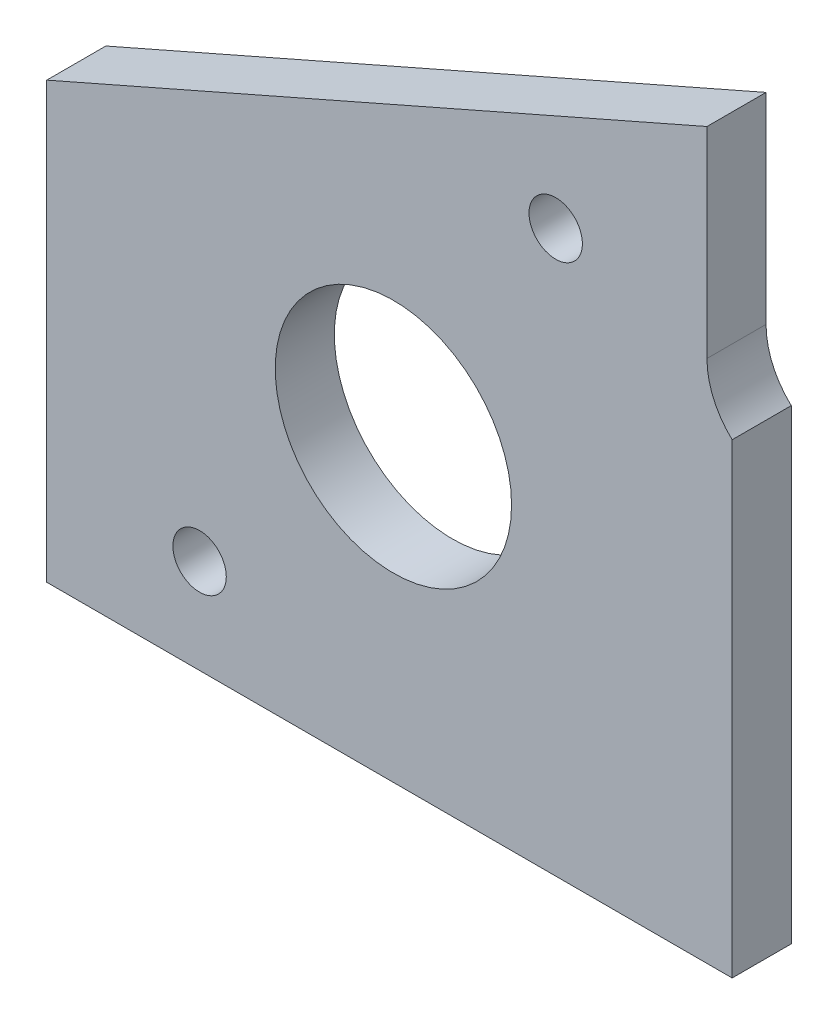
ISO-10303-21;
HEADER;
FILE_DESCRIPTION(('STEP AP214'),'2;1');
FILE_NAME('part.step','',(''),(''),'','','');
FILE_SCHEMA(('AUTOMOTIVE_DESIGN { 1 0 10303 214 1 1 1 1 }'));
ENDSEC;
DATA;
#1=APPLICATION_CONTEXT('core data for automotive mechanical design processes');
#2=APPLICATION_PROTOCOL_DEFINITION('international standard','automotive_design',2000,#1);
#3=PRODUCT_CONTEXT('',#1,'mechanical');
#4=PRODUCT('Part','Part','',(#3));
#5=PRODUCT_RELATED_PRODUCT_CATEGORY('part','',(#4));
#6=PRODUCT_DEFINITION_FORMATION('','',#4);
#7=PRODUCT_DEFINITION_CONTEXT('part definition',#1,'design');
#8=PRODUCT_DEFINITION('design','',#6,#7);
#9=PRODUCT_DEFINITION_SHAPE('','',#8);
#10=(LENGTH_UNIT() NAMED_UNIT(*) SI_UNIT(.MILLI.,.METRE.));
#11=(NAMED_UNIT(*) PLANE_ANGLE_UNIT() SI_UNIT($,.RADIAN.));
#12=(NAMED_UNIT(*) SI_UNIT($,.STERADIAN.) SOLID_ANGLE_UNIT());
#13=UNCERTAINTY_MEASURE_WITH_UNIT(LENGTH_MEASURE(1.E-05),#10,'distance_accuracy_value','');
#14=(GEOMETRIC_REPRESENTATION_CONTEXT(3) GLOBAL_UNCERTAINTY_ASSIGNED_CONTEXT((#13)) GLOBAL_UNIT_ASSIGNED_CONTEXT((#10,
#11,#12)) REPRESENTATION_CONTEXT('',''));
#15=CARTESIAN_POINT('',(0.,0.,0.));
#16=DIRECTION('',(0.,0.,1.));
#17=DIRECTION('',(1.,0.,0.));
#18=AXIS2_PLACEMENT_3D('',#15,#16,#17);
#19=CARTESIAN_POINT('',(-69.2149999999997,22.8600000000018,4.7625));
#20=DIRECTION('',(0.,1.,0.));
#21=DIRECTION('',(0.,0.,1.));
#22=AXIS2_PLACEMENT_3D('',#19,#20,#21);
#23=PLANE('',#22);
#24=DIRECTION('',(1.,0.,0.));
#25=VECTOR('',#24,1.);
#26=CARTESIAN_POINT('',(-69.2149999999997,22.8600000000018,0.));
#27=LINE('',#26,#25);
#28=CARTESIAN_POINT('',(-69.2149999999997,22.8600000000018,0.));
#29=VERTEX_POINT('',#28);
#30=CARTESIAN_POINT('',(-13.9699999999997,22.8600000000018,0.));
#31=VERTEX_POINT('',#30);
#32=EDGE_CURVE('E118',#29,#31,#27,.T.);
#33=ORIENTED_EDGE('',*,*,#32,.T.);
#34=DIRECTION('',(0.,0.,-1.));
#35=VECTOR('',#34,1.);
#36=CARTESIAN_POINT('',(-13.9699999999997,22.8600000000018,4.7625));
#37=LINE('',#36,#35);
#38=CARTESIAN_POINT('',(-13.9699999999997,22.8600000000018,4.7625));
#39=VERTEX_POINT('',#38);
#40=EDGE_CURVE('E11',#39,#31,#37,.T.);
#41=ORIENTED_EDGE('',*,*,#40,.F.);
#42=DIRECTION('',(1.,0.,0.));
#43=VECTOR('',#42,1.);
#44=CARTESIAN_POINT('',(-69.2149999999997,22.8600000000018,4.7625));
#45=LINE('',#44,#43);
#46=CARTESIAN_POINT('',(-69.2149999999997,22.8600000000018,4.7625));
#47=VERTEX_POINT('',#46);
#48=EDGE_CURVE('E130',#47,#39,#45,.T.);
#49=ORIENTED_EDGE('',*,*,#48,.F.);
#50=DIRECTION('',(0.,0.,-1.));
#51=VECTOR('',#50,1.);
#52=CARTESIAN_POINT('',(-69.2149999999997,22.8600000000018,4.7625));
#53=LINE('',#52,#51);
#54=EDGE_CURVE('E114',#47,#29,#53,.T.);
#55=ORIENTED_EDGE('',*,*,#54,.T.);
#56=EDGE_LOOP('',(#33,#41,#49,#55));
#57=FACE_BOUND('',#56,.T.);
#58=ADVANCED_FACE('F34',(#57),#23,.F.);
#59=CARTESIAN_POINT('',(-13.9699999999997,22.8600000000018,4.7625));
#60=DIRECTION('',(-1.,0.,0.));
#61=DIRECTION('',(0.,-1.,0.));
#62=AXIS2_PLACEMENT_3D('',#59,#60,#61);
#63=PLANE('',#62);
#64=DIRECTION('',(0.,1.,0.));
#65=VECTOR('',#64,1.);
#66=CARTESIAN_POINT('',(-13.9699999999997,22.8600000000018,0.));
#67=LINE('',#66,#65);
#68=CARTESIAN_POINT('',(-13.9699999999997,60.4316030939267,0.));
#69=VERTEX_POINT('',#68);
#70=EDGE_CURVE('E121',#31,#69,#67,.T.);
#71=ORIENTED_EDGE('',*,*,#70,.T.);
#72=DIRECTION('',(0.,0.,-1.));
#73=VECTOR('',#72,1.);
#74=CARTESIAN_POINT('',(-13.9699999999997,60.4316030939267,4.7625));
#75=LINE('',#74,#73);
#76=CARTESIAN_POINT('',(-13.9699999999997,60.4316030939267,4.7625));
#77=VERTEX_POINT('',#76);
#78=EDGE_CURVE('E42',#77,#69,#75,.T.);
#79=ORIENTED_EDGE('',*,*,#78,.F.);
#80=DIRECTION('',(0.,1.,0.));
#81=VECTOR('',#80,1.);
#82=CARTESIAN_POINT('',(-13.9699999999997,22.8600000000018,4.7625));
#83=LINE('',#82,#81);
#84=EDGE_CURVE('E87',#39,#77,#83,.T.);
#85=ORIENTED_EDGE('',*,*,#84,.F.);
#86=ORIENTED_EDGE('',*,*,#40,.T.);
#87=EDGE_LOOP('',(#71,#79,#85,#86));
#88=FACE_BOUND('',#87,.T.);
#89=ADVANCED_FACE('F155',(#88),#63,.F.);
#90=CARTESIAN_POINT('',(-9.65199999999967,65.0875000000018,4.7625));
#91=DIRECTION('',(0.,0.,-1.));
#92=DIRECTION('',(-1.,0.,0.));
#93=AXIS2_PLACEMENT_3D('',#90,#91,#92);
#94=CYLINDRICAL_SURFACE('',#93,6.35);
#95=CARTESIAN_POINT('',(-9.65199999999967,65.0875000000018,0.));
#96=DIRECTION('',(0.,0.,-1.));
#97=DIRECTION('',(1.,0.,0.));
#98=AXIS2_PLACEMENT_3D('',#95,#96,#97);
#99=CIRCLE('',#98,6.35);
#100=CARTESIAN_POINT('',(-16.0019999999997,65.0875000000018,0.));
#101=VERTEX_POINT('',#100);
#102=EDGE_CURVE('E124',#69,#101,#99,.T.);
#103=ORIENTED_EDGE('',*,*,#102,.T.);
#104=DIRECTION('',(0.,0.,-1.));
#105=VECTOR('',#104,1.);
#106=CARTESIAN_POINT('',(-16.0019999999997,65.0875000000018,4.7625));
#107=LINE('',#106,#105);
#108=CARTESIAN_POINT('',(-16.0019999999997,65.0875000000018,4.7625));
#109=VERTEX_POINT('',#108);
#110=EDGE_CURVE('E109',#109,#101,#107,.T.);
#111=ORIENTED_EDGE('',*,*,#110,.F.);
#112=CARTESIAN_POINT('',(-9.65199999999967,65.0875000000018,4.7625));
#113=DIRECTION('',(0.,0.,-1.));
#114=DIRECTION('',(1.,0.,0.));
#115=AXIS2_PLACEMENT_3D('',#112,#113,#114);
#116=CIRCLE('',#115,6.35);
#117=EDGE_CURVE('E100',#77,#109,#116,.T.);
#118=ORIENTED_EDGE('',*,*,#117,.F.);
#119=ORIENTED_EDGE('',*,*,#78,.T.);
#120=EDGE_LOOP('',(#103,#111,#118,#119));
#121=FACE_BOUND('',#120,.T.);
#122=ADVANCED_FACE('F136',(#121),#94,.F.);
#123=CARTESIAN_POINT('',(-16.0019999999997,65.0875000000018,4.7625));
#124=DIRECTION('',(-1.,0.,0.));
#125=DIRECTION('',(0.,-1.,0.));
#126=AXIS2_PLACEMENT_3D('',#123,#124,#125);
#127=PLANE('',#126);
#128=DIRECTION('',(0.,1.,0.));
#129=VECTOR('',#128,1.);
#130=CARTESIAN_POINT('',(-16.0019999999997,65.0875000000018,0.));
#131=LINE('',#130,#129);
#132=CARTESIAN_POINT('',(-16.0019999999997,81.2800000000018,0.));
#133=VERTEX_POINT('',#132);
#134=EDGE_CURVE('E108',#101,#133,#131,.T.);
#135=ORIENTED_EDGE('',*,*,#134,.T.);
#136=DIRECTION('',(0.,0.,-1.));
#137=VECTOR('',#136,1.);
#138=CARTESIAN_POINT('',(-16.0019999999997,81.2800000000018,4.7625));
#139=LINE('',#138,#137);
#140=CARTESIAN_POINT('',(-16.0019999999997,81.2800000000018,4.7625));
#141=VERTEX_POINT('',#140);
#142=EDGE_CURVE('E105',#141,#133,#139,.T.);
#143=ORIENTED_EDGE('',*,*,#142,.F.);
#144=DIRECTION('',(0.,1.,0.));
#145=VECTOR('',#144,1.);
#146=CARTESIAN_POINT('',(-16.0019999999997,65.0875000000018,4.7625));
#147=LINE('',#146,#145);
#148=EDGE_CURVE('E94',#109,#141,#147,.T.);
#149=ORIENTED_EDGE('',*,*,#148,.F.);
#150=ORIENTED_EDGE('',*,*,#110,.T.);
#151=EDGE_LOOP('',(#135,#143,#149,#150));
#152=FACE_BOUND('',#151,.T.);
#153=ADVANCED_FACE('F106',(#152),#127,.F.);
#154=CARTESIAN_POINT('',(-16.0019999999997,81.2800000000018,4.7625));
#155=DIRECTION('',(0.402079430480657,-0.91560479006193,0.));
#156=DIRECTION('',(0.91560479006193,0.402079430480657,0.));
#157=AXIS2_PLACEMENT_3D('',#154,#155,#156);
#158=PLANE('',#157);
#159=DIRECTION('',(-0.91560479006193,-0.402079430480657,0.));
#160=VECTOR('',#159,1.);
#161=CARTESIAN_POINT('',(-16.0019999999997,81.2800000000018,0.));
#162=LINE('',#161,#160);
#163=CARTESIAN_POINT('',(-69.2149999999997,57.9120000000018,0.));
#164=VERTEX_POINT('',#163);
#165=EDGE_CURVE('E73',#133,#164,#162,.T.);
#166=ORIENTED_EDGE('',*,*,#165,.T.);
#167=DIRECTION('',(0.,0.,-1.));
#168=VECTOR('',#167,1.);
#169=CARTESIAN_POINT('',(-69.2149999999997,57.9120000000018,4.7625));
#170=LINE('',#169,#168);
#171=CARTESIAN_POINT('',(-69.2149999999997,57.9120000000018,4.7625));
#172=VERTEX_POINT('',#171);
#173=EDGE_CURVE('E110',#172,#164,#170,.T.);
#174=ORIENTED_EDGE('',*,*,#173,.F.);
#175=DIRECTION('',(-0.91560479006193,-0.402079430480657,0.));
#176=VECTOR('',#175,1.);
#177=CARTESIAN_POINT('',(-16.0019999999997,81.2800000000018,4.7625));
#178=LINE('',#177,#176);
#179=EDGE_CURVE('E98',#141,#172,#178,.T.);
#180=ORIENTED_EDGE('',*,*,#179,.F.);
#181=ORIENTED_EDGE('',*,*,#142,.T.);
#182=EDGE_LOOP('',(#166,#174,#180,#181));
#183=FACE_BOUND('',#182,.T.);
#184=ADVANCED_FACE('F112',(#183),#158,.F.);
#185=CARTESIAN_POINT('',(-69.2149999999997,57.9120000000018,4.7625));
#186=DIRECTION('',(1.,0.,0.));
#187=DIRECTION('',(0.,1.,0.));
#188=AXIS2_PLACEMENT_3D('',#185,#186,#187);
#189=PLANE('',#188);
#190=DIRECTION('',(0.,-1.,0.));
#191=VECTOR('',#190,1.);
#192=CARTESIAN_POINT('',(-69.2149999999997,57.9120000000018,0.));
#193=LINE('',#192,#191);
#194=EDGE_CURVE('E79',#164,#29,#193,.T.);
#195=ORIENTED_EDGE('',*,*,#194,.T.);
#196=ORIENTED_EDGE('',*,*,#54,.F.);
#197=DIRECTION('',(0.,-1.,0.));
#198=VECTOR('',#197,1.);
#199=CARTESIAN_POINT('',(-69.2149999999997,57.9120000000018,4.7625));
#200=LINE('',#199,#198);
#201=EDGE_CURVE('E50',#172,#47,#200,.T.);
#202=ORIENTED_EDGE('',*,*,#201,.F.);
#203=ORIENTED_EDGE('',*,*,#173,.T.);
#204=EDGE_LOOP('',(#195,#196,#202,#203));
#205=FACE_BOUND('',#204,.T.);
#206=ADVANCED_FACE('F143',(#205),#189,.F.);
#207=CARTESIAN_POINT('',(-9.65199999999967,65.0875000000018,4.7625));
#208=DIRECTION('',(0.,0.,1.));
#209=DIRECTION('',(1.,0.,0.));
#210=AXIS2_PLACEMENT_3D('',#207,#208,#209);
#211=PLANE('',#210);
#212=CARTESIAN_POINT('',(-56.8959999999997,30.4800000000018,4.7625));
#213=DIRECTION('',(0.,0.,1.));
#214=DIRECTION('',(1.,0.,0.));
#215=AXIS2_PLACEMENT_3D('',#212,#213,#214);
#216=CIRCLE('',#215,2.15265);
#217=CARTESIAN_POINT('',(-54.7433499999997,30.4800000000018,4.7625));
#218=VERTEX_POINT('',#217);
#219=EDGE_CURVE('E231',#218,#218,#216,.T.);
#220=ORIENTED_EDGE('',*,*,#219,.F.);
#221=EDGE_LOOP('',(#220));
#222=FACE_BOUND('',#221,.T.);
#223=CARTESIAN_POINT('',(-28.1939999999997,68.0720000000018,4.7625));
#224=DIRECTION('',(0.,0.,1.));
#225=DIRECTION('',(1.,0.,0.));
#226=AXIS2_PLACEMENT_3D('',#223,#224,#225);
#227=CIRCLE('',#226,2.15265);
#228=CARTESIAN_POINT('',(-26.0413499999997,68.0720000000018,4.7625));
#229=VERTEX_POINT('',#228);
#230=EDGE_CURVE('E233',#229,#229,#227,.T.);
#231=ORIENTED_EDGE('',*,*,#230,.F.);
#232=EDGE_LOOP('',(#231));
#233=FACE_BOUND('',#232,.T.);
#234=CARTESIAN_POINT('',(-41.2749999999997,46.9900000000018,4.7625));
#235=DIRECTION('',(0.,0.,1.));
#236=DIRECTION('',(1.,0.,0.));
#237=AXIS2_PLACEMENT_3D('',#234,#235,#236);
#238=CIRCLE('',#237,9.525);
#239=CARTESIAN_POINT('',(-31.7499999999997,46.9900000000018,4.7625));
#240=VERTEX_POINT('',#239);
#241=EDGE_CURVE('E241',#240,#240,#238,.T.);
#242=ORIENTED_EDGE('',*,*,#241,.F.);
#243=EDGE_LOOP('',(#242));
#244=FACE_BOUND('',#243,.T.);
#245=ORIENTED_EDGE('',*,*,#48,.T.);
#246=ORIENTED_EDGE('',*,*,#84,.T.);
#247=ORIENTED_EDGE('',*,*,#117,.T.);
#248=ORIENTED_EDGE('',*,*,#148,.T.);
#249=ORIENTED_EDGE('',*,*,#179,.T.);
#250=ORIENTED_EDGE('',*,*,#201,.T.);
#251=EDGE_LOOP('',(#245,#246,#247,#248,#249,#250));
#252=FACE_BOUND('',#251,.T.);
#253=ADVANCED_FACE('F96',(#222,#233,#244,#252),#211,.T.);
#254=CARTESIAN_POINT('',(-9.65199999999967,65.0875000000018,0.));
#255=DIRECTION('',(0.,0.,1.));
#256=DIRECTION('',(1.,0.,0.));
#257=AXIS2_PLACEMENT_3D('',#254,#255,#256);
#258=PLANE('',#257);
#259=CARTESIAN_POINT('',(-56.8959999999997,30.4800000000018,0.));
#260=DIRECTION('',(0.,0.,1.));
#261=DIRECTION('',(1.,0.,0.));
#262=AXIS2_PLACEMENT_3D('',#259,#260,#261);
#263=CIRCLE('',#262,2.15265);
#264=CARTESIAN_POINT('',(-54.7433499999997,30.4800000000018,0.));
#265=VERTEX_POINT('',#264);
#266=EDGE_CURVE('E228',#265,#265,#263,.T.);
#267=ORIENTED_EDGE('',*,*,#266,.T.);
#268=EDGE_LOOP('',(#267));
#269=FACE_BOUND('',#268,.T.);
#270=CARTESIAN_POINT('',(-28.1939999999997,68.0720000000018,0.));
#271=DIRECTION('',(0.,0.,1.));
#272=DIRECTION('',(1.,0.,0.));
#273=AXIS2_PLACEMENT_3D('',#270,#271,#272);
#274=CIRCLE('',#273,2.15265);
#275=CARTESIAN_POINT('',(-26.0413499999997,68.0720000000018,0.));
#276=VERTEX_POINT('',#275);
#277=EDGE_CURVE('E238',#276,#276,#274,.T.);
#278=ORIENTED_EDGE('',*,*,#277,.T.);
#279=EDGE_LOOP('',(#278));
#280=FACE_BOUND('',#279,.T.);
#281=CARTESIAN_POINT('',(-41.2749999999997,46.9900000000018,0.));
#282=DIRECTION('',(0.,0.,1.));
#283=DIRECTION('',(1.,0.,0.));
#284=AXIS2_PLACEMENT_3D('',#281,#282,#283);
#285=CIRCLE('',#284,9.525);
#286=CARTESIAN_POINT('',(-31.7499999999997,46.9900000000018,0.));
#287=VERTEX_POINT('',#286);
#288=EDGE_CURVE('E122',#287,#287,#285,.T.);
#289=ORIENTED_EDGE('',*,*,#288,.T.);
#290=EDGE_LOOP('',(#289));
#291=FACE_BOUND('',#290,.T.);
#292=ORIENTED_EDGE('',*,*,#32,.F.);
#293=ORIENTED_EDGE('',*,*,#194,.F.);
#294=ORIENTED_EDGE('',*,*,#165,.F.);
#295=ORIENTED_EDGE('',*,*,#134,.F.);
#296=ORIENTED_EDGE('',*,*,#102,.F.);
#297=ORIENTED_EDGE('',*,*,#70,.F.);
#298=EDGE_LOOP('',(#292,#293,#294,#295,#296,#297));
#299=FACE_BOUND('',#298,.T.);
#300=ADVANCED_FACE('F139',(#269,#280,#291,#299),#258,.F.);
#301=CARTESIAN_POINT('',(-41.2749999999997,46.9900000000018,4.7625));
#302=DIRECTION('',(0.,0.,1.));
#303=DIRECTION('',(1.,0.,0.));
#304=AXIS2_PLACEMENT_3D('',#301,#302,#303);
#305=CYLINDRICAL_SURFACE('',#304,9.525);
#306=ORIENTED_EDGE('',*,*,#288,.F.);
#307=EDGE_LOOP('',(#306));
#308=FACE_BOUND('',#307,.T.);
#309=ORIENTED_EDGE('',*,*,#241,.T.);
#310=EDGE_LOOP('',(#309));
#311=FACE_BOUND('',#310,.T.);
#312=ADVANCED_FACE('F183',(#308,#311),#305,.F.);
#313=CARTESIAN_POINT('',(-28.1939999999997,68.0720000000018,4.7625));
#314=DIRECTION('',(0.,0.,1.));
#315=DIRECTION('',(1.,0.,0.));
#316=AXIS2_PLACEMENT_3D('',#313,#314,#315);
#317=CYLINDRICAL_SURFACE('',#316,2.15265);
#318=ORIENTED_EDGE('',*,*,#277,.F.);
#319=EDGE_LOOP('',(#318));
#320=FACE_BOUND('',#319,.T.);
#321=ORIENTED_EDGE('',*,*,#230,.T.);
#322=EDGE_LOOP('',(#321));
#323=FACE_BOUND('',#322,.T.);
#324=ADVANCED_FACE('F188',(#320,#323),#317,.F.);
#325=CARTESIAN_POINT('',(-56.8959999999997,30.4800000000018,4.7625));
#326=DIRECTION('',(0.,0.,1.));
#327=DIRECTION('',(1.,0.,0.));
#328=AXIS2_PLACEMENT_3D('',#325,#326,#327);
#329=CYLINDRICAL_SURFACE('',#328,2.15265);
#330=ORIENTED_EDGE('',*,*,#266,.F.);
#331=EDGE_LOOP('',(#330));
#332=FACE_BOUND('',#331,.T.);
#333=ORIENTED_EDGE('',*,*,#219,.T.);
#334=EDGE_LOOP('',(#333));
#335=FACE_BOUND('',#334,.T.);
#336=ADVANCED_FACE('F211',(#332,#335),#329,.F.);
#337=CLOSED_SHELL('',(#58,#89,#122,#153,#184,#206,#253,#300,#312,#324,#336));
#338=MANIFOLD_SOLID_BREP('B2',#337);
#339=ADVANCED_BREP_SHAPE_REPRESENTATION('',(#18,#338),#14);
#340=SHAPE_DEFINITION_REPRESENTATION(#9,#339);
ENDSEC;
END-ISO-10303-21;
